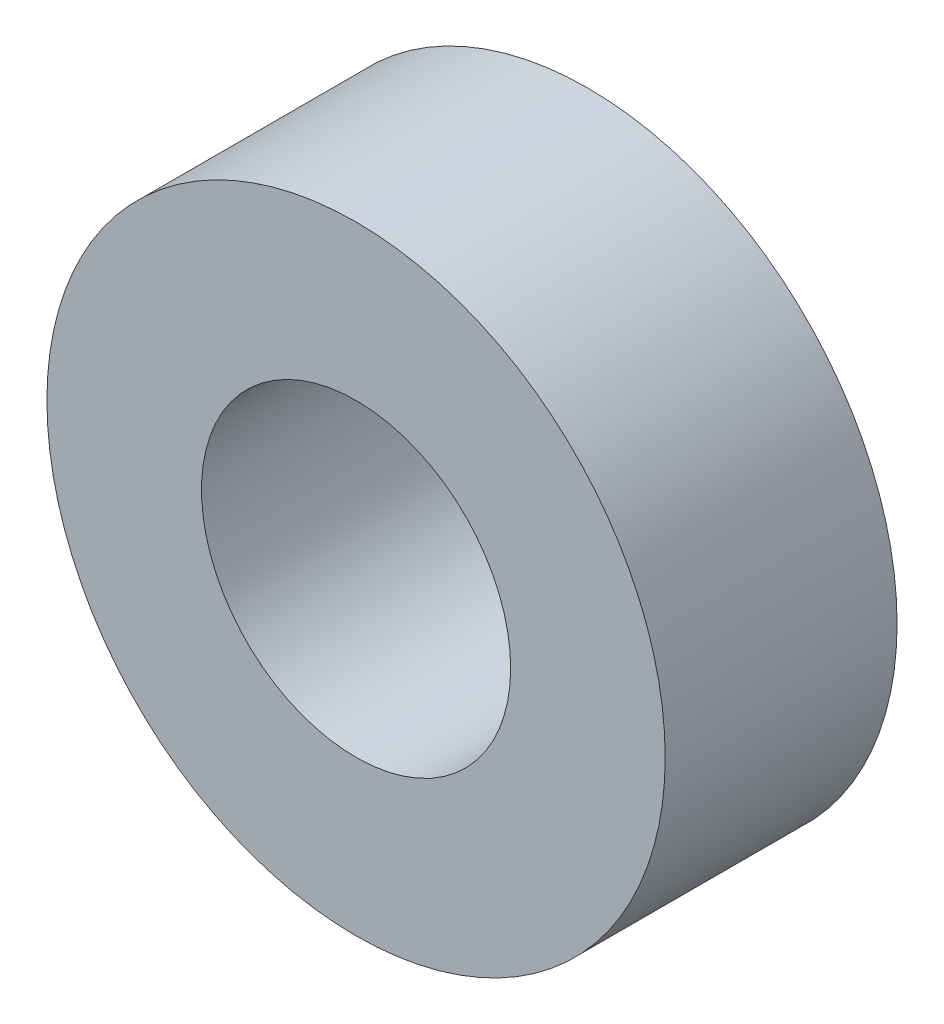
ISO-10303-21;
HEADER;
FILE_DESCRIPTION(('STEP AP214'),'2;1');
FILE_NAME('part.step','',(''),(''),'','','');
FILE_SCHEMA(('AUTOMOTIVE_DESIGN { 1 0 10303 214 1 1 1 1 }'));
ENDSEC;
DATA;
#1=APPLICATION_CONTEXT('core data for automotive mechanical design processes');
#2=APPLICATION_PROTOCOL_DEFINITION('international standard','automotive_design',2000,#1);
#3=PRODUCT_CONTEXT('',#1,'mechanical');
#4=PRODUCT('Part','Part','',(#3));
#5=PRODUCT_RELATED_PRODUCT_CATEGORY('part','',(#4));
#6=PRODUCT_DEFINITION_FORMATION('','',#4);
#7=PRODUCT_DEFINITION_CONTEXT('part definition',#1,'design');
#8=PRODUCT_DEFINITION('design','',#6,#7);
#9=PRODUCT_DEFINITION_SHAPE('','',#8);
#10=(LENGTH_UNIT() NAMED_UNIT(*) SI_UNIT(.MILLI.,.METRE.));
#11=(NAMED_UNIT(*) PLANE_ANGLE_UNIT() SI_UNIT($,.RADIAN.));
#12=(NAMED_UNIT(*) SI_UNIT($,.STERADIAN.) SOLID_ANGLE_UNIT());
#13=UNCERTAINTY_MEASURE_WITH_UNIT(LENGTH_MEASURE(1.E-05),#10,'distance_accuracy_value','');
#14=(GEOMETRIC_REPRESENTATION_CONTEXT(3) GLOBAL_UNCERTAINTY_ASSIGNED_CONTEXT((#13)) GLOBAL_UNIT_ASSIGNED_CONTEXT((#10,
#11,#12)) REPRESENTATION_CONTEXT('',''));
#15=CARTESIAN_POINT('',(0.,0.,0.));
#16=DIRECTION('',(0.,0.,1.));
#17=DIRECTION('',(1.,0.,0.));
#18=AXIS2_PLACEMENT_3D('',#15,#16,#17);
#19=CARTESIAN_POINT('',(0.,0.,9.525));
#20=DIRECTION('',(0.,0.,1.));
#21=DIRECTION('',(1.,0.,0.));
#22=AXIS2_PLACEMENT_3D('',#19,#20,#21);
#23=PLANE('',#22);
#24=CARTESIAN_POINT('',(0.,0.,9.525));
#25=DIRECTION('',(0.,0.,1.));
#26=DIRECTION('',(1.,0.,0.));
#27=AXIS2_PLACEMENT_3D('',#24,#25,#26);
#28=CIRCLE('',#27,25.4);
#29=CARTESIAN_POINT('',(25.4,0.,9.525));
#30=VERTEX_POINT('',#29);
#31=EDGE_CURVE('E10',#30,#30,#28,.T.);
#32=ORIENTED_EDGE('',*,*,#31,.T.);
#33=EDGE_LOOP('',(#32));
#34=FACE_BOUND('',#33,.T.);
#35=CARTESIAN_POINT('',(0.,0.,9.525));
#36=DIRECTION('',(0.,0.,1.));
#37=DIRECTION('',(1.,0.,0.));
#38=AXIS2_PLACEMENT_3D('',#35,#36,#37);
#39=CIRCLE('',#38,12.7);
#40=CARTESIAN_POINT('',(12.7,0.,9.525));
#41=VERTEX_POINT('',#40);
#42=EDGE_CURVE('E49',#41,#41,#39,.T.);
#43=ORIENTED_EDGE('',*,*,#42,.F.);
#44=EDGE_LOOP('',(#43));
#45=FACE_BOUND('',#44,.T.);
#46=ADVANCED_FACE('F38',(#34,#45),#23,.T.);
#47=CARTESIAN_POINT('',(0.,0.,-9.525));
#48=DIRECTION('',(0.,0.,1.));
#49=DIRECTION('',(1.,0.,0.));
#50=AXIS2_PLACEMENT_3D('',#47,#48,#49);
#51=PLANE('',#50);
#52=CARTESIAN_POINT('',(0.,0.,-9.525));
#53=DIRECTION('',(0.,0.,1.));
#54=DIRECTION('',(1.,0.,0.));
#55=AXIS2_PLACEMENT_3D('',#52,#53,#54);
#56=CIRCLE('',#55,25.4);
#57=CARTESIAN_POINT('',(25.4,0.,-9.525));
#58=VERTEX_POINT('',#57);
#59=EDGE_CURVE('E42',#58,#58,#56,.T.);
#60=ORIENTED_EDGE('',*,*,#59,.F.);
#61=EDGE_LOOP('',(#60));
#62=FACE_BOUND('',#61,.T.);
#63=CARTESIAN_POINT('',(0.,0.,-9.525));
#64=DIRECTION('',(0.,0.,1.));
#65=DIRECTION('',(1.,0.,0.));
#66=AXIS2_PLACEMENT_3D('',#63,#64,#65);
#67=CIRCLE('',#66,12.7);
#68=CARTESIAN_POINT('',(12.7,0.,-9.525));
#69=VERTEX_POINT('',#68);
#70=EDGE_CURVE('E51',#69,#69,#67,.T.);
#71=ORIENTED_EDGE('',*,*,#70,.T.);
#72=EDGE_LOOP('',(#71));
#73=FACE_BOUND('',#72,.T.);
#74=ADVANCED_FACE('F61',(#62,#73),#51,.F.);
#75=CARTESIAN_POINT('',(0.,0.,9.525));
#76=DIRECTION('',(0.,0.,-1.));
#77=DIRECTION('',(-1.,0.,0.));
#78=AXIS2_PLACEMENT_3D('',#75,#76,#77);
#79=CYLINDRICAL_SURFACE('',#78,25.4);
#80=ORIENTED_EDGE('',*,*,#31,.F.);
#81=EDGE_LOOP('',(#80));
#82=FACE_BOUND('',#81,.T.);
#83=ORIENTED_EDGE('',*,*,#59,.T.);
#84=EDGE_LOOP('',(#83));
#85=FACE_BOUND('',#84,.T.);
#86=ADVANCED_FACE('F40',(#82,#85),#79,.T.);
#87=CARTESIAN_POINT('',(0.,0.,9.525));
#88=DIRECTION('',(0.,0.,-1.));
#89=DIRECTION('',(-1.,0.,0.));
#90=AXIS2_PLACEMENT_3D('',#87,#88,#89);
#91=CYLINDRICAL_SURFACE('',#90,12.7);
#92=ORIENTED_EDGE('',*,*,#42,.T.);
#93=EDGE_LOOP('',(#92));
#94=FACE_BOUND('',#93,.T.);
#95=ORIENTED_EDGE('',*,*,#70,.F.);
#96=EDGE_LOOP('',(#95));
#97=FACE_BOUND('',#96,.T.);
#98=ADVANCED_FACE('F57',(#94,#97),#91,.F.);
#99=CLOSED_SHELL('',(#46,#74,#86,#98));
#100=MANIFOLD_SOLID_BREP('B2',#99);
#101=ADVANCED_BREP_SHAPE_REPRESENTATION('',(#18,#100),#14);
#102=SHAPE_DEFINITION_REPRESENTATION(#9,#101);
ENDSEC;
END-ISO-10303-21;
